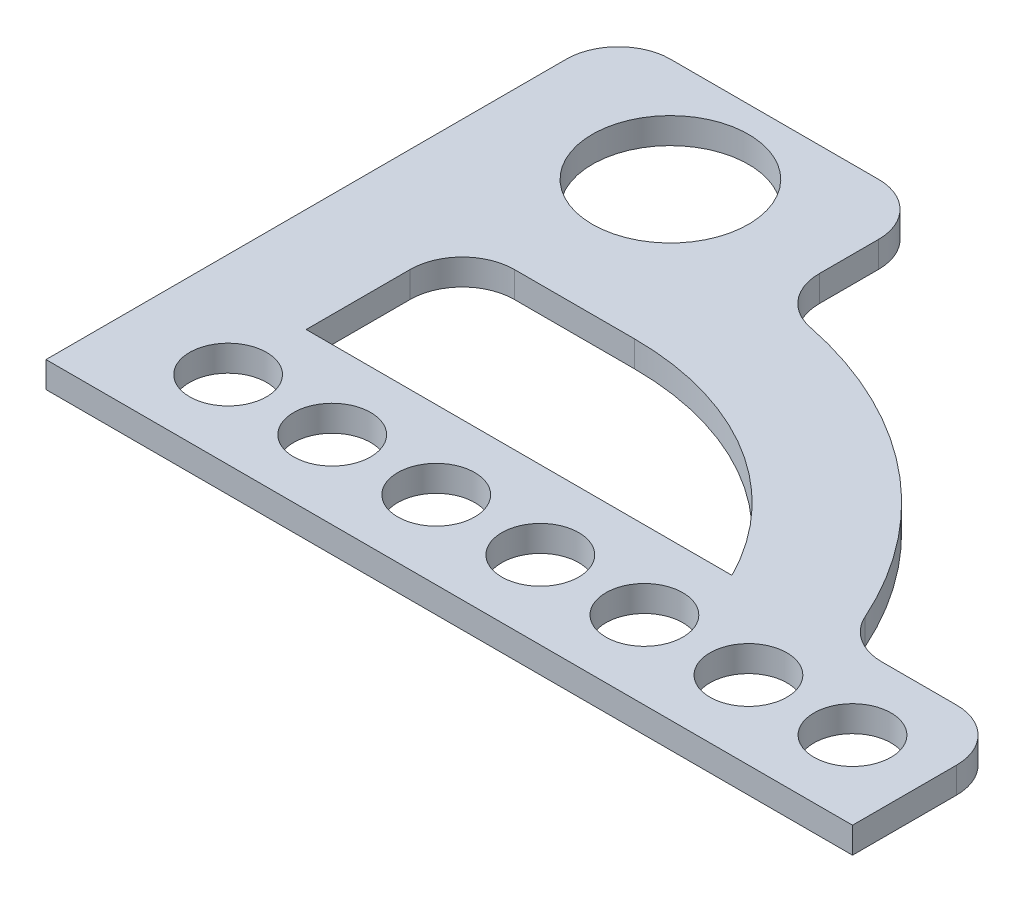
ISO-10303-21;
HEADER;
FILE_DESCRIPTION(('STEP AP214'),'2;1');
FILE_NAME('part.step','',(''),(''),'','','');
FILE_SCHEMA(('AUTOMOTIVE_DESIGN { 1 0 10303 214 1 1 1 1 }'));
ENDSEC;
DATA;
#1=APPLICATION_CONTEXT('core data for automotive mechanical design processes');
#2=APPLICATION_PROTOCOL_DEFINITION('international standard','automotive_design',2000,#1);
#3=PRODUCT_CONTEXT('',#1,'mechanical');
#4=PRODUCT('Part','Part','',(#3));
#5=PRODUCT_RELATED_PRODUCT_CATEGORY('part','',(#4));
#6=PRODUCT_DEFINITION_FORMATION('','',#4);
#7=PRODUCT_DEFINITION_CONTEXT('part definition',#1,'design');
#8=PRODUCT_DEFINITION('design','',#6,#7);
#9=PRODUCT_DEFINITION_SHAPE('','',#8);
#10=(LENGTH_UNIT() NAMED_UNIT(*) SI_UNIT(.MILLI.,.METRE.));
#11=(NAMED_UNIT(*) PLANE_ANGLE_UNIT() SI_UNIT($,.RADIAN.));
#12=(NAMED_UNIT(*) SI_UNIT($,.STERADIAN.) SOLID_ANGLE_UNIT());
#13=UNCERTAINTY_MEASURE_WITH_UNIT(LENGTH_MEASURE(1.E-05),#10,'distance_accuracy_value','');
#14=(GEOMETRIC_REPRESENTATION_CONTEXT(3) GLOBAL_UNCERTAINTY_ASSIGNED_CONTEXT((#13)) GLOBAL_UNIT_ASSIGNED_CONTEXT((#10,
#11,#12)) REPRESENTATION_CONTEXT('',''));
#15=CARTESIAN_POINT('',(0.,0.,0.));
#16=DIRECTION('',(0.,0.,1.));
#17=DIRECTION('',(1.,0.,0.));
#18=AXIS2_PLACEMENT_3D('',#15,#16,#17);
#19=CARTESIAN_POINT('',(155.,5.,0.));
#20=DIRECTION('',(-1.,0.,0.));
#21=DIRECTION('',(0.,0.,1.));
#22=AXIS2_PLACEMENT_3D('',#19,#20,#21);
#23=PLANE('',#22);
#24=DIRECTION('',(0.,0.,-1.));
#25=VECTOR('',#24,1.);
#26=CARTESIAN_POINT('',(155.,0.,0.));
#27=LINE('',#26,#25);
#28=CARTESIAN_POINT('',(155.,0.,0.));
#29=VERTEX_POINT('',#28);
#30=CARTESIAN_POINT('',(155.,0.,-19.9999999999999));
#31=VERTEX_POINT('',#30);
#32=EDGE_CURVE('E249',#29,#31,#27,.T.);
#33=ORIENTED_EDGE('',*,*,#32,.T.);
#34=DIRECTION('',(0.,-1.,0.));
#35=VECTOR('',#34,1.);
#36=CARTESIAN_POINT('',(155.,5.,-19.9999999999999));
#37=LINE('',#36,#35);
#38=CARTESIAN_POINT('',(155.,5.,-19.9999999999999));
#39=VERTEX_POINT('',#38);
#40=EDGE_CURVE('E11',#39,#31,#37,.T.);
#41=ORIENTED_EDGE('',*,*,#40,.F.);
#42=DIRECTION('',(0.,0.,-1.));
#43=VECTOR('',#42,1.);
#44=CARTESIAN_POINT('',(155.,5.,0.));
#45=LINE('',#44,#43);
#46=CARTESIAN_POINT('',(155.,5.,0.));
#47=VERTEX_POINT('',#46);
#48=EDGE_CURVE('E521',#47,#39,#45,.T.);
#49=ORIENTED_EDGE('',*,*,#48,.F.);
#50=DIRECTION('',(0.,-1.,0.));
#51=VECTOR('',#50,1.);
#52=CARTESIAN_POINT('',(155.,5.,0.));
#53=LINE('',#52,#51);
#54=EDGE_CURVE('E291',#47,#29,#53,.T.);
#55=ORIENTED_EDGE('',*,*,#54,.T.);
#56=EDGE_LOOP('',(#33,#41,#49,#55));
#57=FACE_BOUND('',#56,.T.);
#58=ADVANCED_FACE('F39',(#57),#23,.F.);
#59=CARTESIAN_POINT('',(145.,5.,-20.));
#60=DIRECTION('',(0.,-1.,0.));
#61=DIRECTION('',(0.,0.,-1.));
#62=AXIS2_PLACEMENT_3D('',#59,#60,#61);
#63=CYLINDRICAL_SURFACE('',#62,10.);
#64=CARTESIAN_POINT('',(145.,0.,-20.));
#65=DIRECTION('',(0.,1.,0.));
#66=DIRECTION('',(0.,0.,1.));
#67=AXIS2_PLACEMENT_3D('',#64,#65,#66);
#68=CIRCLE('',#67,10.);
#69=CARTESIAN_POINT('',(145.,0.,-30.));
#70=VERTEX_POINT('',#69);
#71=EDGE_CURVE('E253',#31,#70,#68,.T.);
#72=ORIENTED_EDGE('',*,*,#71,.T.);
#73=DIRECTION('',(0.,-1.,0.));
#74=VECTOR('',#73,1.);
#75=CARTESIAN_POINT('',(145.,5.,-30.));
#76=LINE('',#75,#74);
#77=CARTESIAN_POINT('',(145.,5.,-30.));
#78=VERTEX_POINT('',#77);
#79=EDGE_CURVE('E50',#78,#70,#76,.T.);
#80=ORIENTED_EDGE('',*,*,#79,.F.);
#81=CARTESIAN_POINT('',(145.,5.,-20.));
#82=DIRECTION('',(0.,1.,0.));
#83=DIRECTION('',(0.,0.,1.));
#84=AXIS2_PLACEMENT_3D('',#81,#82,#83);
#85=CIRCLE('',#84,10.);
#86=EDGE_CURVE('E523',#39,#78,#85,.T.);
#87=ORIENTED_EDGE('',*,*,#86,.F.);
#88=ORIENTED_EDGE('',*,*,#40,.T.);
#89=EDGE_LOOP('',(#72,#80,#87,#88));
#90=FACE_BOUND('',#89,.T.);
#91=ADVANCED_FACE('F367',(#90),#63,.T.);
#92=CARTESIAN_POINT('',(0.,5.,-30.));
#93=DIRECTION('',(0.,0.,1.));
#94=DIRECTION('',(1.,0.,0.));
#95=AXIS2_PLACEMENT_3D('',#92,#93,#94);
#96=PLANE('',#95);
#97=DIRECTION('',(-1.,0.,0.));
#98=VECTOR('',#97,1.);
#99=CARTESIAN_POINT('',(0.,0.,-30.));
#100=LINE('',#99,#98);
#101=CARTESIAN_POINT('',(130.631756617222,0.,-30.));
#102=VERTEX_POINT('',#101);
#103=EDGE_CURVE('E256',#70,#102,#100,.T.);
#104=ORIENTED_EDGE('',*,*,#103,.T.);
#105=DIRECTION('',(0.,-1.,0.));
#106=VECTOR('',#105,1.);
#107=CARTESIAN_POINT('',(130.631756617222,5.,-30.));
#108=LINE('',#107,#106);
#109=CARTESIAN_POINT('',(130.631756617222,5.,-30.));
#110=VERTEX_POINT('',#109);
#111=EDGE_CURVE('E313',#110,#102,#108,.T.);
#112=ORIENTED_EDGE('',*,*,#111,.F.);
#113=DIRECTION('',(-1.,0.,0.));
#114=VECTOR('',#113,1.);
#115=CARTESIAN_POINT('',(0.,5.,-30.));
#116=LINE('',#115,#114);
#117=EDGE_CURVE('E506',#78,#110,#116,.T.);
#118=ORIENTED_EDGE('',*,*,#117,.F.);
#119=ORIENTED_EDGE('',*,*,#79,.T.);
#120=EDGE_LOOP('',(#104,#112,#118,#119));
#121=FACE_BOUND('',#120,.T.);
#122=ADVANCED_FACE('F373',(#121),#96,.F.);
#123=CARTESIAN_POINT('',(130.631756617222,5.,-40.));
#124=DIRECTION('',(0.,-1.,0.));
#125=DIRECTION('',(0.,0.,-1.));
#126=AXIS2_PLACEMENT_3D('',#123,#124,#125);
#127=CYLINDRICAL_SURFACE('',#126,10.);
#128=CARTESIAN_POINT('',(130.631756617222,0.,-40.));
#129=DIRECTION('',(0.,1.,0.));
#130=DIRECTION('',(0.,0.,1.));
#131=AXIS2_PLACEMENT_3D('',#128,#129,#130);
#132=CIRCLE('',#131,10.);
#133=CARTESIAN_POINT('',(121.497679456988,0.,-35.9295412505603));
#134=VERTEX_POINT('',#133);
#135=EDGE_CURVE('E259',#102,#134,#132,.F.);
#136=ORIENTED_EDGE('',*,*,#135,.T.);
#137=DIRECTION('',(0.,-1.,0.));
#138=VECTOR('',#137,1.);
#139=CARTESIAN_POINT('',(121.497679456988,5.,-35.9295412505603));
#140=LINE('',#139,#138);
#141=CARTESIAN_POINT('',(121.497679456988,5.,-35.9295412505603));
#142=VERTEX_POINT('',#141);
#143=EDGE_CURVE('E310',#142,#134,#140,.T.);
#144=ORIENTED_EDGE('',*,*,#143,.F.);
#145=CARTESIAN_POINT('',(130.631756617222,5.,-40.));
#146=DIRECTION('',(0.,1.,0.));
#147=DIRECTION('',(0.,0.,1.));
#148=AXIS2_PLACEMENT_3D('',#145,#146,#147);
#149=CIRCLE('',#148,10.);
#150=EDGE_CURVE('E490',#110,#142,#149,.F.);
#151=ORIENTED_EDGE('',*,*,#150,.F.);
#152=ORIENTED_EDGE('',*,*,#111,.T.);
#153=EDGE_LOOP('',(#136,#144,#151,#152));
#154=FACE_BOUND('',#153,.T.);
#155=ADVANCED_FACE('F475',(#154),#127,.F.);
#156=CARTESIAN_POINT('',(53.1222248068049,5.,-5.45908837991499));
#157=DIRECTION('',(0.,-1.,0.));
#158=DIRECTION('',(0.,0.,-1.));
#159=AXIS2_PLACEMENT_3D('',#156,#157,#158);
#160=CYLINDRICAL_SURFACE('',#159,74.8575400127566);
#161=CARTESIAN_POINT('',(53.1222248068049,0.,-5.45908837991499));
#162=DIRECTION('',(0.,1.,0.));
#163=DIRECTION('',(0.,0.,1.));
#164=AXIS2_PLACEMENT_3D('',#161,#162,#163);
#165=CIRCLE('',#164,74.8575400127566);
#166=CARTESIAN_POINT('',(68.0110459022666,0.,-78.8210288064658));
#167=VERTEX_POINT('',#166);
#168=EDGE_CURVE('E263',#167,#134,#165,.F.);
#169=ORIENTED_EDGE('',*,*,#168,.F.);
#170=DIRECTION('',(0.,-1.,0.));
#171=VECTOR('',#170,1.);
#172=CARTESIAN_POINT('',(68.0110459022666,5.,-78.8210288064658));
#173=LINE('',#172,#171);
#174=CARTESIAN_POINT('',(68.0110459022666,5.,-78.8210288064658));
#175=VERTEX_POINT('',#174);
#176=EDGE_CURVE('E307',#175,#167,#173,.T.);
#177=ORIENTED_EDGE('',*,*,#176,.F.);
#178=CARTESIAN_POINT('',(53.1222248068049,5.,-5.45908837991499));
#179=DIRECTION('',(0.,1.,0.));
#180=DIRECTION('',(0.,0.,1.));
#181=AXIS2_PLACEMENT_3D('',#178,#179,#180);
#182=CIRCLE('',#181,74.8575400127566);
#183=EDGE_CURVE('E496',#175,#142,#182,.F.);
#184=ORIENTED_EDGE('',*,*,#183,.T.);
#185=ORIENTED_EDGE('',*,*,#143,.T.);
#186=EDGE_LOOP('',(#169,#177,#184,#185));
#187=FACE_BOUND('',#186,.T.);
#188=ADVANCED_FACE('F471',(#187),#160,.T.);
#189=CARTESIAN_POINT('',(70.,5.,-88.6212360286172));
#190=DIRECTION('',(0.,-1.,0.));
#191=DIRECTION('',(0.,0.,-1.));
#192=AXIS2_PLACEMENT_3D('',#189,#190,#191);
#193=CYLINDRICAL_SURFACE('',#192,9.99999999999999);
#194=CARTESIAN_POINT('',(70.,0.,-88.6212360286172));
#195=DIRECTION('',(0.,1.,0.));
#196=DIRECTION('',(0.,0.,1.));
#197=AXIS2_PLACEMENT_3D('',#194,#195,#196);
#198=CIRCLE('',#197,9.99999999999999);
#199=CARTESIAN_POINT('',(60.,0.,-88.6212360286172));
#200=VERTEX_POINT('',#199);
#201=EDGE_CURVE('E267',#200,#167,#198,.T.);
#202=ORIENTED_EDGE('',*,*,#201,.F.);
#203=DIRECTION('',(0.,-1.,0.));
#204=VECTOR('',#203,1.);
#205=CARTESIAN_POINT('',(60.,5.,-88.6212360286172));
#206=LINE('',#205,#204);
#207=CARTESIAN_POINT('',(60.,5.,-88.6212360286172));
#208=VERTEX_POINT('',#207);
#209=EDGE_CURVE('E304',#208,#200,#206,.T.);
#210=ORIENTED_EDGE('',*,*,#209,.F.);
#211=CARTESIAN_POINT('',(70.,5.,-88.6212360286172));
#212=DIRECTION('',(0.,1.,0.));
#213=DIRECTION('',(0.,0.,1.));
#214=AXIS2_PLACEMENT_3D('',#211,#212,#213);
#215=CIRCLE('',#214,9.99999999999999);
#216=EDGE_CURVE('E500',#208,#175,#215,.T.);
#217=ORIENTED_EDGE('',*,*,#216,.T.);
#218=ORIENTED_EDGE('',*,*,#176,.T.);
#219=EDGE_LOOP('',(#202,#210,#217,#218));
#220=FACE_BOUND('',#219,.T.);
#221=ADVANCED_FACE('F467',(#220),#193,.F.);
#222=CARTESIAN_POINT('',(60.0000000000001,5.,0.));
#223=DIRECTION('',(1.,0.,0.));
#224=DIRECTION('',(0.,0.,-1.));
#225=AXIS2_PLACEMENT_3D('',#222,#223,#224);
#226=PLANE('',#225);
#227=DIRECTION('',(0.,0.,1.));
#228=VECTOR('',#227,1.);
#229=CARTESIAN_POINT('',(60.0000000000001,0.,0.));
#230=LINE('',#229,#228);
#231=CARTESIAN_POINT('',(60.,0.,-99.9999999999999));
#232=VERTEX_POINT('',#231);
#233=EDGE_CURVE('E271',#232,#200,#230,.T.);
#234=ORIENTED_EDGE('',*,*,#233,.F.);
#235=DIRECTION('',(0.,-1.,0.));
#236=VECTOR('',#235,1.);
#237=CARTESIAN_POINT('',(60.,5.,-99.9999999999999));
#238=LINE('',#237,#236);
#239=CARTESIAN_POINT('',(60.,5.,-99.9999999999999));
#240=VERTEX_POINT('',#239);
#241=EDGE_CURVE('E301',#240,#232,#238,.T.);
#242=ORIENTED_EDGE('',*,*,#241,.F.);
#243=DIRECTION('',(0.,0.,1.));
#244=VECTOR('',#243,1.);
#245=CARTESIAN_POINT('',(60.0000000000001,5.,0.));
#246=LINE('',#245,#244);
#247=EDGE_CURVE('E504',#240,#208,#246,.T.);
#248=ORIENTED_EDGE('',*,*,#247,.T.);
#249=ORIENTED_EDGE('',*,*,#209,.T.);
#250=EDGE_LOOP('',(#234,#242,#248,#249));
#251=FACE_BOUND('',#250,.T.);
#252=ADVANCED_FACE('F463',(#251),#226,.T.);
#253=CARTESIAN_POINT('',(50.,5.,-100.));
#254=DIRECTION('',(0.,-1.,0.));
#255=DIRECTION('',(0.,0.,-1.));
#256=AXIS2_PLACEMENT_3D('',#253,#254,#255);
#257=CYLINDRICAL_SURFACE('',#256,9.99999999999999);
#258=CARTESIAN_POINT('',(50.,0.,-100.));
#259=DIRECTION('',(0.,1.,0.));
#260=DIRECTION('',(0.,0.,1.));
#261=AXIS2_PLACEMENT_3D('',#258,#259,#260);
#262=CIRCLE('',#261,9.99999999999999);
#263=CARTESIAN_POINT('',(49.9999999999999,0.,-110.));
#264=VERTEX_POINT('',#263);
#265=EDGE_CURVE('E275',#264,#232,#262,.F.);
#266=ORIENTED_EDGE('',*,*,#265,.F.);
#267=DIRECTION('',(0.,-1.,0.));
#268=VECTOR('',#267,1.);
#269=CARTESIAN_POINT('',(49.9999999999999,5.,-110.));
#270=LINE('',#269,#268);
#271=CARTESIAN_POINT('',(49.9999999999999,5.,-110.));
#272=VERTEX_POINT('',#271);
#273=EDGE_CURVE('E298',#272,#264,#270,.T.);
#274=ORIENTED_EDGE('',*,*,#273,.F.);
#275=CARTESIAN_POINT('',(50.,5.,-100.));
#276=DIRECTION('',(0.,1.,0.));
#277=DIRECTION('',(0.,0.,1.));
#278=AXIS2_PLACEMENT_3D('',#275,#276,#277);
#279=CIRCLE('',#278,9.99999999999999);
#280=EDGE_CURVE('E513',#272,#240,#279,.F.);
#281=ORIENTED_EDGE('',*,*,#280,.T.);
#282=ORIENTED_EDGE('',*,*,#241,.T.);
#283=EDGE_LOOP('',(#266,#274,#281,#282));
#284=FACE_BOUND('',#283,.T.);
#285=ADVANCED_FACE('F459',(#284),#257,.T.);
#286=CARTESIAN_POINT('',(0.,5.,-110.));
#287=DIRECTION('',(0.,0.,-1.));
#288=DIRECTION('',(-1.,0.,0.));
#289=AXIS2_PLACEMENT_3D('',#286,#287,#288);
#290=PLANE('',#289);
#291=DIRECTION('',(1.,0.,0.));
#292=VECTOR('',#291,1.);
#293=CARTESIAN_POINT('',(0.,0.,-110.));
#294=LINE('',#293,#292);
#295=CARTESIAN_POINT('',(10.0000000000001,0.,-110.));
#296=VERTEX_POINT('',#295);
#297=EDGE_CURVE('E279',#296,#264,#294,.T.);
#298=ORIENTED_EDGE('',*,*,#297,.F.);
#299=DIRECTION('',(0.,-1.,0.));
#300=VECTOR('',#299,1.);
#301=CARTESIAN_POINT('',(10.0000000000001,5.,-110.));
#302=LINE('',#301,#300);
#303=CARTESIAN_POINT('',(10.0000000000001,5.,-110.));
#304=VERTEX_POINT('',#303);
#305=EDGE_CURVE('E179',#304,#296,#302,.T.);
#306=ORIENTED_EDGE('',*,*,#305,.F.);
#307=DIRECTION('',(1.,0.,0.));
#308=VECTOR('',#307,1.);
#309=CARTESIAN_POINT('',(0.,5.,-110.));
#310=LINE('',#309,#308);
#311=EDGE_CURVE('E186',#304,#272,#310,.T.);
#312=ORIENTED_EDGE('',*,*,#311,.T.);
#313=ORIENTED_EDGE('',*,*,#273,.T.);
#314=EDGE_LOOP('',(#298,#306,#312,#313));
#315=FACE_BOUND('',#314,.T.);
#316=ADVANCED_FACE('F456',(#315),#290,.T.);
#317=CARTESIAN_POINT('',(10.,5.,-100.));
#318=DIRECTION('',(0.,-1.,0.));
#319=DIRECTION('',(0.,0.,-1.));
#320=AXIS2_PLACEMENT_3D('',#317,#318,#319);
#321=CYLINDRICAL_SURFACE('',#320,10.);
#322=CARTESIAN_POINT('',(10.,0.,-100.));
#323=DIRECTION('',(0.,1.,0.));
#324=DIRECTION('',(0.,0.,1.));
#325=AXIS2_PLACEMENT_3D('',#322,#323,#324);
#326=CIRCLE('',#325,10.);
#327=CARTESIAN_POINT('',(0.,0.,-99.9999999999999));
#328=VERTEX_POINT('',#327);
#329=EDGE_CURVE('E173',#328,#296,#326,.F.);
#330=ORIENTED_EDGE('',*,*,#329,.F.);
#331=DIRECTION('',(0.,-1.,0.));
#332=VECTOR('',#331,1.);
#333=CARTESIAN_POINT('',(0.,5.,-99.9999999999999));
#334=LINE('',#333,#332);
#335=CARTESIAN_POINT('',(0.,5.,-99.9999999999999));
#336=VERTEX_POINT('',#335);
#337=EDGE_CURVE('E168',#336,#328,#334,.T.);
#338=ORIENTED_EDGE('',*,*,#337,.F.);
#339=CARTESIAN_POINT('',(10.,5.,-100.));
#340=DIRECTION('',(0.,1.,0.));
#341=DIRECTION('',(0.,0.,1.));
#342=AXIS2_PLACEMENT_3D('',#339,#340,#341);
#343=CIRCLE('',#342,10.);
#344=EDGE_CURVE('E171',#336,#304,#343,.F.);
#345=ORIENTED_EDGE('',*,*,#344,.T.);
#346=ORIENTED_EDGE('',*,*,#305,.T.);
#347=EDGE_LOOP('',(#330,#338,#345,#346));
#348=FACE_BOUND('',#347,.T.);
#349=ADVANCED_FACE('F170',(#348),#321,.T.);
#350=CARTESIAN_POINT('',(0.,5.,0.));
#351=DIRECTION('',(-1.,0.,0.));
#352=DIRECTION('',(0.,0.,1.));
#353=AXIS2_PLACEMENT_3D('',#350,#351,#352);
#354=PLANE('',#353);
#355=DIRECTION('',(0.,0.,-1.));
#356=VECTOR('',#355,1.);
#357=CARTESIAN_POINT('',(0.,0.,0.));
#358=LINE('',#357,#356);
#359=CARTESIAN_POINT('',(0.,0.,0.));
#360=VERTEX_POINT('',#359);
#361=EDGE_CURVE('E285',#360,#328,#358,.T.);
#362=ORIENTED_EDGE('',*,*,#361,.F.);
#363=DIRECTION('',(0.,-1.,0.));
#364=VECTOR('',#363,1.);
#365=CARTESIAN_POINT('',(0.,5.,0.));
#366=LINE('',#365,#364);
#367=CARTESIAN_POINT('',(0.,5.,0.));
#368=VERTEX_POINT('',#367);
#369=EDGE_CURVE('E114',#368,#360,#366,.T.);
#370=ORIENTED_EDGE('',*,*,#369,.F.);
#371=DIRECTION('',(0.,0.,-1.));
#372=VECTOR('',#371,1.);
#373=CARTESIAN_POINT('',(0.,5.,0.));
#374=LINE('',#373,#372);
#375=EDGE_CURVE('E183',#368,#336,#374,.T.);
#376=ORIENTED_EDGE('',*,*,#375,.T.);
#377=ORIENTED_EDGE('',*,*,#337,.T.);
#378=EDGE_LOOP('',(#362,#370,#376,#377));
#379=FACE_BOUND('',#378,.T.);
#380=ADVANCED_FACE('F189',(#379),#354,.T.);
#381=CARTESIAN_POINT('',(30.,5.,-50.));
#382=DIRECTION('',(0.,-1.,0.));
#383=DIRECTION('',(0.,0.,-1.));
#384=AXIS2_PLACEMENT_3D('',#381,#382,#383);
#385=CYLINDRICAL_SURFACE('',#384,10.);
#386=CARTESIAN_POINT('',(30.,0.,-50.));
#387=DIRECTION('',(0.,1.,0.));
#388=DIRECTION('',(0.,0.,1.));
#389=AXIS2_PLACEMENT_3D('',#386,#387,#388);
#390=CIRCLE('',#389,10.);
#391=CARTESIAN_POINT('',(30.0000000000001,0.,-60.));
#392=VERTEX_POINT('',#391);
#393=CARTESIAN_POINT('',(20.,0.,-49.9999999999999));
#394=VERTEX_POINT('',#393);
#395=EDGE_CURVE('E229',#392,#394,#390,.T.);
#396=ORIENTED_EDGE('',*,*,#395,.F.);
#397=DIRECTION('',(0.,-1.,0.));
#398=VECTOR('',#397,1.);
#399=CARTESIAN_POINT('',(30.0000000000001,5.,-60.));
#400=LINE('',#399,#398);
#401=CARTESIAN_POINT('',(30.0000000000001,5.,-60.));
#402=VERTEX_POINT('',#401);
#403=EDGE_CURVE('E43',#402,#392,#400,.T.);
#404=ORIENTED_EDGE('',*,*,#403,.F.);
#405=CARTESIAN_POINT('',(30.,5.,-50.));
#406=DIRECTION('',(0.,1.,0.));
#407=DIRECTION('',(0.,0.,1.));
#408=AXIS2_PLACEMENT_3D('',#405,#406,#407);
#409=CIRCLE('',#408,10.);
#410=CARTESIAN_POINT('',(20.,5.,-49.9999999999999));
#411=VERTEX_POINT('',#410);
#412=EDGE_CURVE('E344',#402,#411,#409,.T.);
#413=ORIENTED_EDGE('',*,*,#412,.T.);
#414=DIRECTION('',(0.,-1.,0.));
#415=VECTOR('',#414,1.);
#416=CARTESIAN_POINT('',(20.,5.,-49.9999999999999));
#417=LINE('',#416,#415);
#418=EDGE_CURVE('E193',#411,#394,#417,.T.);
#419=ORIENTED_EDGE('',*,*,#418,.T.);
#420=EDGE_LOOP('',(#396,#404,#413,#419));
#421=FACE_BOUND('',#420,.T.);
#422=ADVANCED_FACE('F343',(#421),#385,.F.);
#423=CARTESIAN_POINT('',(0.,5.,-60.));
#424=DIRECTION('',(0.,0.,-1.));
#425=DIRECTION('',(-1.,0.,0.));
#426=AXIS2_PLACEMENT_3D('',#423,#424,#425);
#427=PLANE('',#426);
#428=DIRECTION('',(1.,0.,0.));
#429=VECTOR('',#428,1.);
#430=CARTESIAN_POINT('',(0.,0.,-60.));
#431=LINE('',#430,#429);
#432=CARTESIAN_POINT('',(53.1222248068049,0.,-60.));
#433=VERTEX_POINT('',#432);
#434=EDGE_CURVE('E233',#392,#433,#431,.T.);
#435=ORIENTED_EDGE('',*,*,#434,.T.);
#436=DIRECTION('',(0.,-1.,0.));
#437=VECTOR('',#436,1.);
#438=CARTESIAN_POINT('',(53.1222248068049,5.,-60.));
#439=LINE('',#438,#437);
#440=CARTESIAN_POINT('',(53.1222248068049,5.,-60.));
#441=VERTEX_POINT('',#440);
#442=EDGE_CURVE('E327',#441,#433,#439,.T.);
#443=ORIENTED_EDGE('',*,*,#442,.F.);
#444=DIRECTION('',(1.,0.,0.));
#445=VECTOR('',#444,1.);
#446=CARTESIAN_POINT('',(0.,5.,-60.));
#447=LINE('',#446,#445);
#448=EDGE_CURVE('E337',#402,#441,#447,.T.);
#449=ORIENTED_EDGE('',*,*,#448,.F.);
#450=ORIENTED_EDGE('',*,*,#403,.T.);
#451=EDGE_LOOP('',(#435,#443,#449,#450));
#452=FACE_BOUND('',#451,.T.);
#453=ADVANCED_FACE('F335',(#452),#427,.F.);
#454=CARTESIAN_POINT('',(53.1222248068049,5.,-5.45908837991499));
#455=DIRECTION('',(0.,-1.,0.));
#456=DIRECTION('',(0.,0.,-1.));
#457=AXIS2_PLACEMENT_3D('',#454,#455,#456);
#458=CYLINDRICAL_SURFACE('',#457,54.540911620085);
#459=CARTESIAN_POINT('',(53.1222248068049,0.,-5.45908837991499));
#460=DIRECTION('',(0.,1.,0.));
#461=DIRECTION('',(0.,0.,1.));
#462=AXIS2_PLACEMENT_3D('',#459,#460,#461);
#463=CIRCLE('',#462,54.540911620085);
#464=CARTESIAN_POINT('',(101.830075274723,0.,-30.));
#465=VERTEX_POINT('',#464);
#466=EDGE_CURVE('E237',#433,#465,#463,.F.);
#467=ORIENTED_EDGE('',*,*,#466,.T.);
#468=DIRECTION('',(0.,-1.,0.));
#469=VECTOR('',#468,1.);
#470=CARTESIAN_POINT('',(101.830075274723,5.,-30.));
#471=LINE('',#470,#469);
#472=CARTESIAN_POINT('',(101.830075274723,5.,-30.));
#473=VERTEX_POINT('',#472);
#474=EDGE_CURVE('E325',#473,#465,#471,.T.);
#475=ORIENTED_EDGE('',*,*,#474,.F.);
#476=CARTESIAN_POINT('',(53.1222248068049,5.,-5.45908837991499));
#477=DIRECTION('',(0.,1.,0.));
#478=DIRECTION('',(0.,0.,1.));
#479=AXIS2_PLACEMENT_3D('',#476,#477,#478);
#480=CIRCLE('',#479,54.540911620085);
#481=EDGE_CURVE('E533',#441,#473,#480,.F.);
#482=ORIENTED_EDGE('',*,*,#481,.F.);
#483=ORIENTED_EDGE('',*,*,#442,.T.);
#484=EDGE_LOOP('',(#467,#475,#482,#483));
#485=FACE_BOUND('',#484,.T.);
#486=ADVANCED_FACE('F357',(#485),#458,.F.);
#487=CARTESIAN_POINT('',(0.,5.,-30.));
#488=DIRECTION('',(0.,0.,-1.));
#489=DIRECTION('',(-1.,0.,0.));
#490=AXIS2_PLACEMENT_3D('',#487,#488,#489);
#491=PLANE('',#490);
#492=DIRECTION('',(1.,0.,0.));
#493=VECTOR('',#492,1.);
#494=CARTESIAN_POINT('',(0.,0.,-30.));
#495=LINE('',#494,#493);
#496=CARTESIAN_POINT('',(20.,0.,-30.));
#497=VERTEX_POINT('',#496);
#498=EDGE_CURVE('E241',#497,#465,#495,.T.);
#499=ORIENTED_EDGE('',*,*,#498,.F.);
#500=DIRECTION('',(0.,-1.,0.));
#501=VECTOR('',#500,1.);
#502=CARTESIAN_POINT('',(20.,5.,-30.));
#503=LINE('',#502,#501);
#504=CARTESIAN_POINT('',(20.,5.,-30.));
#505=VERTEX_POINT('',#504);
#506=EDGE_CURVE('E322',#505,#497,#503,.T.);
#507=ORIENTED_EDGE('',*,*,#506,.F.);
#508=DIRECTION('',(1.,0.,0.));
#509=VECTOR('',#508,1.);
#510=CARTESIAN_POINT('',(0.,5.,-30.));
#511=LINE('',#510,#509);
#512=EDGE_CURVE('E356',#505,#473,#511,.T.);
#513=ORIENTED_EDGE('',*,*,#512,.T.);
#514=ORIENTED_EDGE('',*,*,#474,.T.);
#515=EDGE_LOOP('',(#499,#507,#513,#514));
#516=FACE_BOUND('',#515,.T.);
#517=ADVANCED_FACE('F352',(#516),#491,.T.);
#518=CARTESIAN_POINT('',(20.,5.,0.));
#519=DIRECTION('',(1.,0.,0.));
#520=DIRECTION('',(0.,0.,-1.));
#521=AXIS2_PLACEMENT_3D('',#518,#519,#520);
#522=PLANE('',#521);
#523=DIRECTION('',(0.,0.,1.));
#524=VECTOR('',#523,1.);
#525=CARTESIAN_POINT('',(20.,0.,0.));
#526=LINE('',#525,#524);
#527=EDGE_CURVE('E245',#394,#497,#526,.T.);
#528=ORIENTED_EDGE('',*,*,#527,.F.);
#529=ORIENTED_EDGE('',*,*,#418,.F.);
#530=DIRECTION('',(0.,0.,1.));
#531=VECTOR('',#530,1.);
#532=CARTESIAN_POINT('',(20.,5.,0.));
#533=LINE('',#532,#531);
#534=EDGE_CURVE('E349',#411,#505,#533,.T.);
#535=ORIENTED_EDGE('',*,*,#534,.T.);
#536=ORIENTED_EDGE('',*,*,#506,.T.);
#537=EDGE_LOOP('',(#528,#529,#535,#536));
#538=FACE_BOUND('',#537,.T.);
#539=ADVANCED_FACE('F348',(#538),#522,.T.);
#540=CARTESIAN_POINT('',(140.,5.,-15.));
#541=DIRECTION('',(0.,-1.,0.));
#542=DIRECTION('',(0.,0.,-1.));
#543=AXIS2_PLACEMENT_3D('',#540,#541,#542);
#544=CYLINDRICAL_SURFACE('',#543,7.39682371760364);
#545=CARTESIAN_POINT('',(140.,5.,-15.));
#546=DIRECTION('',(0.,1.,0.));
#547=DIRECTION('',(0.,0.,1.));
#548=AXIS2_PLACEMENT_3D('',#545,#546,#547);
#549=CIRCLE('',#548,7.39682371760364);
#550=CARTESIAN_POINT('',(140.,5.,-7.60317628239636));
#551=VERTEX_POINT('',#550);
#552=EDGE_CURVE('E540',#551,#551,#549,.T.);
#553=ORIENTED_EDGE('',*,*,#552,.T.);
#554=EDGE_LOOP('',(#553));
#555=FACE_BOUND('',#554,.T.);
#556=CARTESIAN_POINT('',(140.,0.,-15.));
#557=DIRECTION('',(0.,1.,0.));
#558=DIRECTION('',(0.,0.,1.));
#559=AXIS2_PLACEMENT_3D('',#556,#557,#558);
#560=CIRCLE('',#559,7.39682371760364);
#561=CARTESIAN_POINT('',(140.,0.,-7.60317628239636));
#562=VERTEX_POINT('',#561);
#563=EDGE_CURVE('E225',#562,#562,#560,.T.);
#564=ORIENTED_EDGE('',*,*,#563,.F.);
#565=EDGE_LOOP('',(#564));
#566=FACE_BOUND('',#565,.T.);
#567=ADVANCED_FACE('F379',(#555,#566),#544,.F.);
#568=CARTESIAN_POINT('',(120.,5.,-15.));
#569=DIRECTION('',(0.,-1.,0.));
#570=DIRECTION('',(0.,0.,-1.));
#571=AXIS2_PLACEMENT_3D('',#568,#569,#570);
#572=CYLINDRICAL_SURFACE('',#571,7.39682371760363);
#573=CARTESIAN_POINT('',(120.,5.,-15.));
#574=DIRECTION('',(0.,1.,0.));
#575=DIRECTION('',(0.,0.,1.));
#576=AXIS2_PLACEMENT_3D('',#573,#574,#575);
#577=CIRCLE('',#576,7.39682371760363);
#578=CARTESIAN_POINT('',(120.,5.,-7.60317628239637));
#579=VERTEX_POINT('',#578);
#580=EDGE_CURVE('E543',#579,#579,#577,.T.);
#581=ORIENTED_EDGE('',*,*,#580,.T.);
#582=EDGE_LOOP('',(#581));
#583=FACE_BOUND('',#582,.T.);
#584=CARTESIAN_POINT('',(120.,0.,-15.));
#585=DIRECTION('',(0.,1.,0.));
#586=DIRECTION('',(0.,0.,1.));
#587=AXIS2_PLACEMENT_3D('',#584,#585,#586);
#588=CIRCLE('',#587,7.39682371760363);
#589=CARTESIAN_POINT('',(120.,0.,-7.60317628239637));
#590=VERTEX_POINT('',#589);
#591=EDGE_CURVE('E221',#590,#590,#588,.T.);
#592=ORIENTED_EDGE('',*,*,#591,.F.);
#593=EDGE_LOOP('',(#592));
#594=FACE_BOUND('',#593,.T.);
#595=ADVANCED_FACE('F383',(#583,#594),#572,.F.);
#596=CARTESIAN_POINT('',(100.,5.,-15.));
#597=DIRECTION('',(0.,-1.,0.));
#598=DIRECTION('',(0.,0.,-1.));
#599=AXIS2_PLACEMENT_3D('',#596,#597,#598);
#600=CYLINDRICAL_SURFACE('',#599,7.39682371760363);
#601=CARTESIAN_POINT('',(100.,5.,-15.));
#602=DIRECTION('',(0.,1.,0.));
#603=DIRECTION('',(0.,0.,1.));
#604=AXIS2_PLACEMENT_3D('',#601,#602,#603);
#605=CIRCLE('',#604,7.39682371760363);
#606=CARTESIAN_POINT('',(100.,5.,-7.60317628239637));
#607=VERTEX_POINT('',#606);
#608=EDGE_CURVE('E547',#607,#607,#605,.T.);
#609=ORIENTED_EDGE('',*,*,#608,.T.);
#610=EDGE_LOOP('',(#609));
#611=FACE_BOUND('',#610,.T.);
#612=CARTESIAN_POINT('',(100.,0.,-15.));
#613=DIRECTION('',(0.,1.,0.));
#614=DIRECTION('',(0.,0.,1.));
#615=AXIS2_PLACEMENT_3D('',#612,#613,#614);
#616=CIRCLE('',#615,7.39682371760363);
#617=CARTESIAN_POINT('',(100.,0.,-7.60317628239637));
#618=VERTEX_POINT('',#617);
#619=EDGE_CURVE('E217',#618,#618,#616,.T.);
#620=ORIENTED_EDGE('',*,*,#619,.F.);
#621=EDGE_LOOP('',(#620));
#622=FACE_BOUND('',#621,.T.);
#623=ADVANCED_FACE('F389',(#611,#622),#600,.F.);
#624=CARTESIAN_POINT('',(80.,5.,-15.));
#625=DIRECTION('',(0.,-1.,0.));
#626=DIRECTION('',(0.,0.,-1.));
#627=AXIS2_PLACEMENT_3D('',#624,#625,#626);
#628=CYLINDRICAL_SURFACE('',#627,7.39682371760363);
#629=CARTESIAN_POINT('',(80.,5.,-15.));
#630=DIRECTION('',(0.,1.,0.));
#631=DIRECTION('',(0.,0.,1.));
#632=AXIS2_PLACEMENT_3D('',#629,#630,#631);
#633=CIRCLE('',#632,7.39682371760363);
#634=CARTESIAN_POINT('',(80.,5.,-7.60317628239637));
#635=VERTEX_POINT('',#634);
#636=EDGE_CURVE('E551',#635,#635,#633,.T.);
#637=ORIENTED_EDGE('',*,*,#636,.T.);
#638=EDGE_LOOP('',(#637));
#639=FACE_BOUND('',#638,.T.);
#640=CARTESIAN_POINT('',(80.,0.,-15.));
#641=DIRECTION('',(0.,1.,0.));
#642=DIRECTION('',(0.,0.,1.));
#643=AXIS2_PLACEMENT_3D('',#640,#641,#642);
#644=CIRCLE('',#643,7.39682371760363);
#645=CARTESIAN_POINT('',(80.,0.,-7.60317628239637));
#646=VERTEX_POINT('',#645);
#647=EDGE_CURVE('E213',#646,#646,#644,.T.);
#648=ORIENTED_EDGE('',*,*,#647,.F.);
#649=EDGE_LOOP('',(#648));
#650=FACE_BOUND('',#649,.T.);
#651=ADVANCED_FACE('F398',(#639,#650),#628,.F.);
#652=CARTESIAN_POINT('',(60.,5.,-15.));
#653=DIRECTION('',(0.,-1.,0.));
#654=DIRECTION('',(0.,0.,-1.));
#655=AXIS2_PLACEMENT_3D('',#652,#653,#654);
#656=CYLINDRICAL_SURFACE('',#655,7.39682371760363);
#657=CARTESIAN_POINT('',(60.,5.,-15.));
#658=DIRECTION('',(0.,1.,0.));
#659=DIRECTION('',(0.,0.,1.));
#660=AXIS2_PLACEMENT_3D('',#657,#658,#659);
#661=CIRCLE('',#660,7.39682371760363);
#662=CARTESIAN_POINT('',(60.,5.,-7.60317628239637));
#663=VERTEX_POINT('',#662);
#664=EDGE_CURVE('E555',#663,#663,#661,.T.);
#665=ORIENTED_EDGE('',*,*,#664,.T.);
#666=EDGE_LOOP('',(#665));
#667=FACE_BOUND('',#666,.T.);
#668=CARTESIAN_POINT('',(60.,0.,-15.));
#669=DIRECTION('',(0.,1.,0.));
#670=DIRECTION('',(0.,0.,1.));
#671=AXIS2_PLACEMENT_3D('',#668,#669,#670);
#672=CIRCLE('',#671,7.39682371760363);
#673=CARTESIAN_POINT('',(60.,0.,-7.60317628239637));
#674=VERTEX_POINT('',#673);
#675=EDGE_CURVE('E209',#674,#674,#672,.T.);
#676=ORIENTED_EDGE('',*,*,#675,.F.);
#677=EDGE_LOOP('',(#676));
#678=FACE_BOUND('',#677,.T.);
#679=ADVANCED_FACE('F402',(#667,#678),#656,.F.);
#680=CARTESIAN_POINT('',(40.,5.,-15.));
#681=DIRECTION('',(0.,-1.,0.));
#682=DIRECTION('',(0.,0.,-1.));
#683=AXIS2_PLACEMENT_3D('',#680,#681,#682);
#684=CYLINDRICAL_SURFACE('',#683,7.39682371760363);
#685=CARTESIAN_POINT('',(40.,5.,-15.));
#686=DIRECTION('',(0.,1.,0.));
#687=DIRECTION('',(0.,0.,1.));
#688=AXIS2_PLACEMENT_3D('',#685,#686,#687);
#689=CIRCLE('',#688,7.39682371760363);
#690=CARTESIAN_POINT('',(40.,5.,-7.60317628239637));
#691=VERTEX_POINT('',#690);
#692=EDGE_CURVE('E559',#691,#691,#689,.T.);
#693=ORIENTED_EDGE('',*,*,#692,.T.);
#694=EDGE_LOOP('',(#693));
#695=FACE_BOUND('',#694,.T.);
#696=CARTESIAN_POINT('',(40.,0.,-15.));
#697=DIRECTION('',(0.,1.,0.));
#698=DIRECTION('',(0.,0.,1.));
#699=AXIS2_PLACEMENT_3D('',#696,#697,#698);
#700=CIRCLE('',#699,7.39682371760363);
#701=CARTESIAN_POINT('',(40.,0.,-7.60317628239637));
#702=VERTEX_POINT('',#701);
#703=EDGE_CURVE('E205',#702,#702,#700,.T.);
#704=ORIENTED_EDGE('',*,*,#703,.F.);
#705=EDGE_LOOP('',(#704));
#706=FACE_BOUND('',#705,.T.);
#707=ADVANCED_FACE('F406',(#695,#706),#684,.F.);
#708=CARTESIAN_POINT('',(20.,5.,-15.));
#709=DIRECTION('',(0.,-1.,0.));
#710=DIRECTION('',(0.,0.,-1.));
#711=AXIS2_PLACEMENT_3D('',#708,#709,#710);
#712=CYLINDRICAL_SURFACE('',#711,7.39682371760363);
#713=CARTESIAN_POINT('',(20.,5.,-15.));
#714=DIRECTION('',(0.,1.,0.));
#715=DIRECTION('',(0.,0.,1.));
#716=AXIS2_PLACEMENT_3D('',#713,#714,#715);
#717=CIRCLE('',#716,7.39682371760363);
#718=CARTESIAN_POINT('',(20.,5.,-7.60317628239637));
#719=VERTEX_POINT('',#718);
#720=EDGE_CURVE('E421',#719,#719,#717,.T.);
#721=ORIENTED_EDGE('',*,*,#720,.T.);
#722=EDGE_LOOP('',(#721));
#723=FACE_BOUND('',#722,.T.);
#724=CARTESIAN_POINT('',(20.,0.,-15.));
#725=DIRECTION('',(0.,1.,0.));
#726=DIRECTION('',(0.,0.,1.));
#727=AXIS2_PLACEMENT_3D('',#724,#725,#726);
#728=CIRCLE('',#727,7.39682371760363);
#729=CARTESIAN_POINT('',(20.,0.,-7.60317628239637));
#730=VERTEX_POINT('',#729);
#731=EDGE_CURVE('E201',#730,#730,#728,.T.);
#732=ORIENTED_EDGE('',*,*,#731,.F.);
#733=EDGE_LOOP('',(#732));
#734=FACE_BOUND('',#733,.T.);
#735=ADVANCED_FACE('F409',(#723,#734),#712,.F.);
#736=CARTESIAN_POINT('',(30.,5.,-90.));
#737=DIRECTION('',(0.,-1.,0.));
#738=DIRECTION('',(0.,0.,-1.));
#739=AXIS2_PLACEMENT_3D('',#736,#737,#738);
#740=CYLINDRICAL_SURFACE('',#739,15.);
#741=CARTESIAN_POINT('',(30.,5.,-90.));
#742=DIRECTION('',(0.,1.,0.));
#743=DIRECTION('',(0.,0.,1.));
#744=AXIS2_PLACEMENT_3D('',#741,#742,#743);
#745=CIRCLE('',#744,15.);
#746=CARTESIAN_POINT('',(30.,5.,-75.));
#747=VERTEX_POINT('',#746);
#748=EDGE_CURVE('E290',#747,#747,#745,.T.);
#749=ORIENTED_EDGE('',*,*,#748,.T.);
#750=EDGE_LOOP('',(#749));
#751=FACE_BOUND('',#750,.T.);
#752=CARTESIAN_POINT('',(30.,0.,-90.));
#753=DIRECTION('',(0.,1.,0.));
#754=DIRECTION('',(0.,0.,1.));
#755=AXIS2_PLACEMENT_3D('',#752,#753,#754);
#756=CIRCLE('',#755,15.);
#757=CARTESIAN_POINT('',(30.,0.,-75.));
#758=VERTEX_POINT('',#757);
#759=EDGE_CURVE('E197',#758,#758,#756,.T.);
#760=ORIENTED_EDGE('',*,*,#759,.F.);
#761=EDGE_LOOP('',(#760));
#762=FACE_BOUND('',#761,.T.);
#763=ADVANCED_FACE('F41',(#751,#762),#740,.F.);
#764=CARTESIAN_POINT('',(0.,5.,0.));
#765=DIRECTION('',(0.,0.,-1.));
#766=DIRECTION('',(-1.,0.,0.));
#767=AXIS2_PLACEMENT_3D('',#764,#765,#766);
#768=PLANE('',#767);
#769=DIRECTION('',(1.,0.,0.));
#770=VECTOR('',#769,1.);
#771=CARTESIAN_POINT('',(0.,0.,0.));
#772=LINE('',#771,#770);
#773=EDGE_CURVE('E117',#360,#29,#772,.T.);
#774=ORIENTED_EDGE('',*,*,#773,.T.);
#775=ORIENTED_EDGE('',*,*,#54,.F.);
#776=DIRECTION('',(1.,0.,0.));
#777=VECTOR('',#776,1.);
#778=CARTESIAN_POINT('',(0.,5.,0.));
#779=LINE('',#778,#777);
#780=EDGE_CURVE('E59',#368,#47,#779,.T.);
#781=ORIENTED_EDGE('',*,*,#780,.F.);
#782=ORIENTED_EDGE('',*,*,#369,.T.);
#783=EDGE_LOOP('',(#774,#775,#781,#782));
#784=FACE_BOUND('',#783,.T.);
#785=ADVANCED_FACE('F416',(#784),#768,.F.);
#786=CARTESIAN_POINT('',(0.,5.,0.));
#787=DIRECTION('',(0.,1.,0.));
#788=DIRECTION('',(0.,0.,1.));
#789=AXIS2_PLACEMENT_3D('',#786,#787,#788);
#790=PLANE('',#789);
#791=ORIENTED_EDGE('',*,*,#748,.F.);
#792=EDGE_LOOP('',(#791));
#793=FACE_BOUND('',#792,.T.);
#794=ORIENTED_EDGE('',*,*,#720,.F.);
#795=EDGE_LOOP('',(#794));
#796=FACE_BOUND('',#795,.T.);
#797=ORIENTED_EDGE('',*,*,#692,.F.);
#798=EDGE_LOOP('',(#797));
#799=FACE_BOUND('',#798,.T.);
#800=ORIENTED_EDGE('',*,*,#664,.F.);
#801=EDGE_LOOP('',(#800));
#802=FACE_BOUND('',#801,.T.);
#803=ORIENTED_EDGE('',*,*,#636,.F.);
#804=EDGE_LOOP('',(#803));
#805=FACE_BOUND('',#804,.T.);
#806=ORIENTED_EDGE('',*,*,#608,.F.);
#807=EDGE_LOOP('',(#806));
#808=FACE_BOUND('',#807,.T.);
#809=ORIENTED_EDGE('',*,*,#580,.F.);
#810=EDGE_LOOP('',(#809));
#811=FACE_BOUND('',#810,.T.);
#812=ORIENTED_EDGE('',*,*,#552,.F.);
#813=EDGE_LOOP('',(#812));
#814=FACE_BOUND('',#813,.T.);
#815=ORIENTED_EDGE('',*,*,#412,.F.);
#816=ORIENTED_EDGE('',*,*,#448,.T.);
#817=ORIENTED_EDGE('',*,*,#481,.T.);
#818=ORIENTED_EDGE('',*,*,#512,.F.);
#819=ORIENTED_EDGE('',*,*,#534,.F.);
#820=EDGE_LOOP('',(#815,#816,#817,#818,#819));
#821=FACE_BOUND('',#820,.T.);
#822=ORIENTED_EDGE('',*,*,#48,.T.);
#823=ORIENTED_EDGE('',*,*,#86,.T.);
#824=ORIENTED_EDGE('',*,*,#117,.T.);
#825=ORIENTED_EDGE('',*,*,#150,.T.);
#826=ORIENTED_EDGE('',*,*,#183,.F.);
#827=ORIENTED_EDGE('',*,*,#216,.F.);
#828=ORIENTED_EDGE('',*,*,#247,.F.);
#829=ORIENTED_EDGE('',*,*,#280,.F.);
#830=ORIENTED_EDGE('',*,*,#311,.F.);
#831=ORIENTED_EDGE('',*,*,#344,.F.);
#832=ORIENTED_EDGE('',*,*,#375,.F.);
#833=ORIENTED_EDGE('',*,*,#780,.T.);
#834=EDGE_LOOP('',(#822,#823,#824,#825,#826,#827,#828,#829,#830,#831,#832,#833));
#835=FACE_BOUND('',#834,.T.);
#836=ADVANCED_FACE('F182',(#793,#796,#799,#802,#805,#808,#811,#814,#821,#835),#790,.T.);
#837=CARTESIAN_POINT('',(0.,0.,0.));
#838=DIRECTION('',(0.,1.,0.));
#839=DIRECTION('',(0.,0.,1.));
#840=AXIS2_PLACEMENT_3D('',#837,#838,#839);
#841=PLANE('',#840);
#842=ORIENTED_EDGE('',*,*,#759,.T.);
#843=EDGE_LOOP('',(#842));
#844=FACE_BOUND('',#843,.T.);
#845=ORIENTED_EDGE('',*,*,#731,.T.);
#846=EDGE_LOOP('',(#845));
#847=FACE_BOUND('',#846,.T.);
#848=ORIENTED_EDGE('',*,*,#703,.T.);
#849=EDGE_LOOP('',(#848));
#850=FACE_BOUND('',#849,.T.);
#851=ORIENTED_EDGE('',*,*,#675,.T.);
#852=EDGE_LOOP('',(#851));
#853=FACE_BOUND('',#852,.T.);
#854=ORIENTED_EDGE('',*,*,#647,.T.);
#855=EDGE_LOOP('',(#854));
#856=FACE_BOUND('',#855,.T.);
#857=ORIENTED_EDGE('',*,*,#619,.T.);
#858=EDGE_LOOP('',(#857));
#859=FACE_BOUND('',#858,.T.);
#860=ORIENTED_EDGE('',*,*,#591,.T.);
#861=EDGE_LOOP('',(#860));
#862=FACE_BOUND('',#861,.T.);
#863=ORIENTED_EDGE('',*,*,#563,.T.);
#864=EDGE_LOOP('',(#863));
#865=FACE_BOUND('',#864,.T.);
#866=ORIENTED_EDGE('',*,*,#395,.T.);
#867=ORIENTED_EDGE('',*,*,#527,.T.);
#868=ORIENTED_EDGE('',*,*,#498,.T.);
#869=ORIENTED_EDGE('',*,*,#466,.F.);
#870=ORIENTED_EDGE('',*,*,#434,.F.);
#871=EDGE_LOOP('',(#866,#867,#868,#869,#870));
#872=FACE_BOUND('',#871,.T.);
#873=ORIENTED_EDGE('',*,*,#32,.F.);
#874=ORIENTED_EDGE('',*,*,#773,.F.);
#875=ORIENTED_EDGE('',*,*,#361,.T.);
#876=ORIENTED_EDGE('',*,*,#329,.T.);
#877=ORIENTED_EDGE('',*,*,#297,.T.);
#878=ORIENTED_EDGE('',*,*,#265,.T.);
#879=ORIENTED_EDGE('',*,*,#233,.T.);
#880=ORIENTED_EDGE('',*,*,#201,.T.);
#881=ORIENTED_EDGE('',*,*,#168,.T.);
#882=ORIENTED_EDGE('',*,*,#135,.F.);
#883=ORIENTED_EDGE('',*,*,#103,.F.);
#884=ORIENTED_EDGE('',*,*,#71,.F.);
#885=EDGE_LOOP('',(#873,#874,#875,#876,#877,#878,#879,#880,#881,#882,#883,#884));
#886=FACE_BOUND('',#885,.T.);
#887=ADVANCED_FACE('F340',(#844,#847,#850,#853,#856,#859,#862,#865,#872,#886),#841,.F.);
#888=CLOSED_SHELL('',(#58,#91,#122,#155,#188,#221,#252,#285,#316,#349,#380,#422,#453,#486,#517,
#539,#567,#595,#623,#651,#679,#707,#735,#763,#785,#836,#887));
#889=MANIFOLD_SOLID_BREP('B2',#888);
#890=ADVANCED_BREP_SHAPE_REPRESENTATION('',(#18,#889),#14);
#891=SHAPE_DEFINITION_REPRESENTATION(#9,#890);
ENDSEC;
END-ISO-10303-21;
